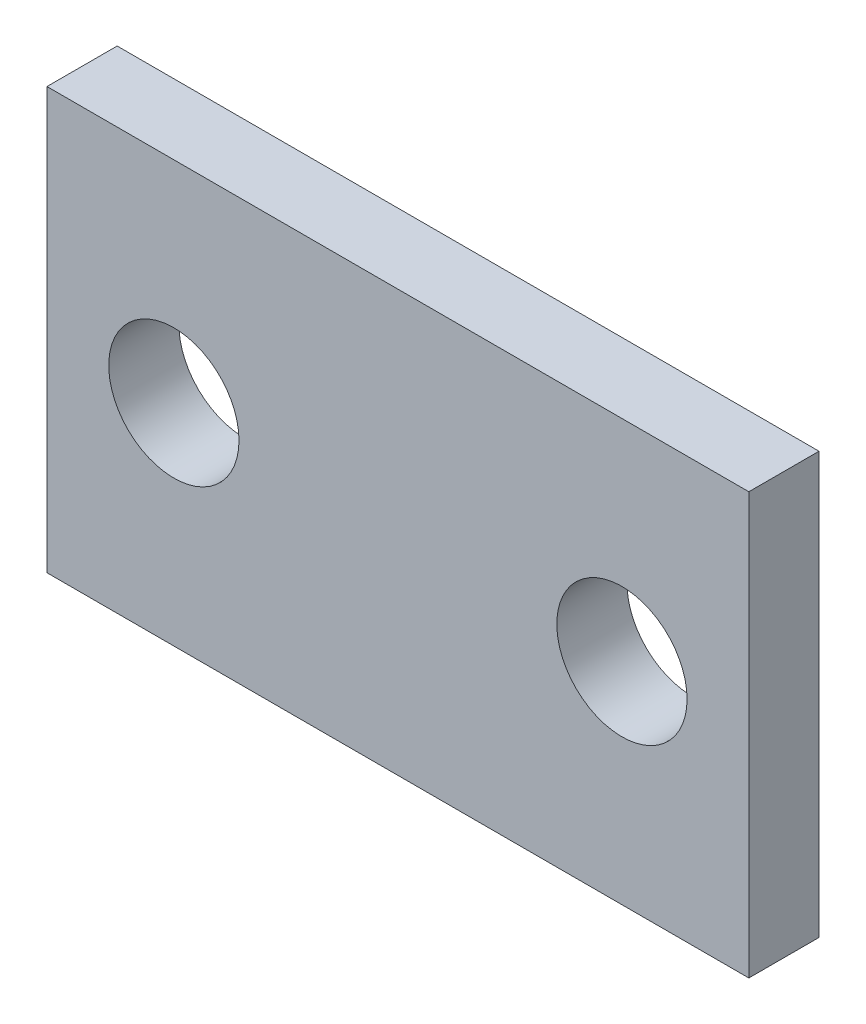
ISO-10303-21;
HEADER;
FILE_DESCRIPTION(('STEP AP214'),'2;1');
FILE_NAME('part.step','',(''),(''),'','','');
FILE_SCHEMA(('AUTOMOTIVE_DESIGN { 1 0 10303 214 1 1 1 1 }'));
ENDSEC;
DATA;
#1=APPLICATION_CONTEXT('core data for automotive mechanical design processes');
#2=APPLICATION_PROTOCOL_DEFINITION('international standard','automotive_design',2000,#1);
#3=PRODUCT_CONTEXT('',#1,'mechanical');
#4=PRODUCT('Part','Part','',(#3));
#5=PRODUCT_RELATED_PRODUCT_CATEGORY('part','',(#4));
#6=PRODUCT_DEFINITION_FORMATION('','',#4);
#7=PRODUCT_DEFINITION_CONTEXT('part definition',#1,'design');
#8=PRODUCT_DEFINITION('design','',#6,#7);
#9=PRODUCT_DEFINITION_SHAPE('','',#8);
#10=(LENGTH_UNIT() NAMED_UNIT(*) SI_UNIT(.MILLI.,.METRE.));
#11=(NAMED_UNIT(*) PLANE_ANGLE_UNIT() SI_UNIT($,.RADIAN.));
#12=(NAMED_UNIT(*) SI_UNIT($,.STERADIAN.) SOLID_ANGLE_UNIT());
#13=UNCERTAINTY_MEASURE_WITH_UNIT(LENGTH_MEASURE(1.E-05),#10,'distance_accuracy_value','');
#14=(GEOMETRIC_REPRESENTATION_CONTEXT(3) GLOBAL_UNCERTAINTY_ASSIGNED_CONTEXT((#13)) GLOBAL_UNIT_ASSIGNED_CONTEXT((#10,
#11,#12)) REPRESENTATION_CONTEXT('',''));
#15=CARTESIAN_POINT('',(0.,0.,0.));
#16=DIRECTION('',(0.,0.,1.));
#17=DIRECTION('',(1.,0.,0.));
#18=AXIS2_PLACEMENT_3D('',#15,#16,#17);
#19=CARTESIAN_POINT('',(7.9375,4.76250000000001,1.5875));
#20=DIRECTION('',(-1.,0.,0.));
#21=DIRECTION('',(0.,-1.,0.));
#22=AXIS2_PLACEMENT_3D('',#19,#20,#21);
#23=PLANE('',#22);
#24=DIRECTION('',(0.,1.,0.));
#25=VECTOR('',#24,1.);
#26=CARTESIAN_POINT('',(7.9375,4.76250000000001,0.));
#27=LINE('',#26,#25);
#28=CARTESIAN_POINT('',(7.9375,-4.7625,0.));
#29=VERTEX_POINT('',#28);
#30=CARTESIAN_POINT('',(7.9375,4.76250000000001,0.));
#31=VERTEX_POINT('',#30);
#32=EDGE_CURVE('E98',#29,#31,#27,.T.);
#33=ORIENTED_EDGE('',*,*,#32,.T.);
#34=DIRECTION('',(0.,0.,-1.));
#35=VECTOR('',#34,1.);
#36=CARTESIAN_POINT('',(7.9375,4.76250000000001,1.5875));
#37=LINE('',#36,#35);
#38=CARTESIAN_POINT('',(7.9375,4.76250000000001,1.5875));
#39=VERTEX_POINT('',#38);
#40=EDGE_CURVE('E11',#39,#31,#37,.T.);
#41=ORIENTED_EDGE('',*,*,#40,.F.);
#42=DIRECTION('',(0.,1.,0.));
#43=VECTOR('',#42,1.);
#44=CARTESIAN_POINT('',(7.9375,4.76250000000001,1.5875));
#45=LINE('',#44,#43);
#46=CARTESIAN_POINT('',(7.9375,-4.7625,1.5875));
#47=VERTEX_POINT('',#46);
#48=EDGE_CURVE('E86',#47,#39,#45,.T.);
#49=ORIENTED_EDGE('',*,*,#48,.F.);
#50=DIRECTION('',(0.,0.,-1.));
#51=VECTOR('',#50,1.);
#52=CARTESIAN_POINT('',(7.9375,-4.7625,1.5875));
#53=LINE('',#52,#51);
#54=EDGE_CURVE('E94',#47,#29,#53,.T.);
#55=ORIENTED_EDGE('',*,*,#54,.T.);
#56=EDGE_LOOP('',(#33,#41,#49,#55));
#57=FACE_BOUND('',#56,.T.);
#58=ADVANCED_FACE('F35',(#57),#23,.F.);
#59=CARTESIAN_POINT('',(-7.9375,4.76250000000001,1.5875));
#60=DIRECTION('',(0.,-1.,0.));
#61=DIRECTION('',(0.,0.,-1.));
#62=AXIS2_PLACEMENT_3D('',#59,#60,#61);
#63=PLANE('',#62);
#64=DIRECTION('',(-1.,0.,0.));
#65=VECTOR('',#64,1.);
#66=CARTESIAN_POINT('',(-7.9375,4.76250000000001,0.));
#67=LINE('',#66,#65);
#68=CARTESIAN_POINT('',(-7.9375,4.76250000000001,0.));
#69=VERTEX_POINT('',#68);
#70=EDGE_CURVE('E90',#31,#69,#67,.T.);
#71=ORIENTED_EDGE('',*,*,#70,.T.);
#72=DIRECTION('',(0.,0.,-1.));
#73=VECTOR('',#72,1.);
#74=CARTESIAN_POINT('',(-7.9375,4.76250000000001,1.5875));
#75=LINE('',#74,#73);
#76=CARTESIAN_POINT('',(-7.9375,4.76250000000001,1.5875));
#77=VERTEX_POINT('',#76);
#78=EDGE_CURVE('E43',#77,#69,#75,.T.);
#79=ORIENTED_EDGE('',*,*,#78,.F.);
#80=DIRECTION('',(-1.,0.,0.));
#81=VECTOR('',#80,1.);
#82=CARTESIAN_POINT('',(-7.9375,4.76250000000001,1.5875));
#83=LINE('',#82,#81);
#84=EDGE_CURVE('E81',#39,#77,#83,.T.);
#85=ORIENTED_EDGE('',*,*,#84,.F.);
#86=ORIENTED_EDGE('',*,*,#40,.T.);
#87=EDGE_LOOP('',(#71,#79,#85,#86));
#88=FACE_BOUND('',#87,.T.);
#89=ADVANCED_FACE('F89',(#88),#63,.F.);
#90=CARTESIAN_POINT('',(-7.9375,4.76250000000001,1.5875));
#91=DIRECTION('',(1.,0.,0.));
#92=DIRECTION('',(0.,1.,0.));
#93=AXIS2_PLACEMENT_3D('',#90,#91,#92);
#94=PLANE('',#93);
#95=DIRECTION('',(0.,-1.,0.));
#96=VECTOR('',#95,1.);
#97=CARTESIAN_POINT('',(-7.9375,4.76250000000001,0.));
#98=LINE('',#97,#96);
#99=CARTESIAN_POINT('',(-7.9375,-4.7625,0.));
#100=VERTEX_POINT('',#99);
#101=EDGE_CURVE('E68',#69,#100,#98,.T.);
#102=ORIENTED_EDGE('',*,*,#101,.T.);
#103=DIRECTION('',(0.,0.,-1.));
#104=VECTOR('',#103,1.);
#105=CARTESIAN_POINT('',(-7.9375,-4.7625,1.5875));
#106=LINE('',#105,#104);
#107=CARTESIAN_POINT('',(-7.9375,-4.7625,1.5875));
#108=VERTEX_POINT('',#107);
#109=EDGE_CURVE('E91',#108,#100,#106,.T.);
#110=ORIENTED_EDGE('',*,*,#109,.F.);
#111=DIRECTION('',(0.,-1.,0.));
#112=VECTOR('',#111,1.);
#113=CARTESIAN_POINT('',(-7.9375,4.76250000000001,1.5875));
#114=LINE('',#113,#112);
#115=EDGE_CURVE('E84',#77,#108,#114,.T.);
#116=ORIENTED_EDGE('',*,*,#115,.F.);
#117=ORIENTED_EDGE('',*,*,#78,.T.);
#118=EDGE_LOOP('',(#102,#110,#116,#117));
#119=FACE_BOUND('',#118,.T.);
#120=ADVANCED_FACE('F92',(#119),#94,.F.);
#121=CARTESIAN_POINT('',(-7.9375,-4.7625,1.5875));
#122=DIRECTION('',(0.,1.,0.));
#123=DIRECTION('',(0.,0.,1.));
#124=AXIS2_PLACEMENT_3D('',#121,#122,#123);
#125=PLANE('',#124);
#126=DIRECTION('',(1.,0.,0.));
#127=VECTOR('',#126,1.);
#128=CARTESIAN_POINT('',(-7.9375,-4.7625,0.));
#129=LINE('',#128,#127);
#130=EDGE_CURVE('E74',#100,#29,#129,.T.);
#131=ORIENTED_EDGE('',*,*,#130,.T.);
#132=ORIENTED_EDGE('',*,*,#54,.F.);
#133=DIRECTION('',(1.,0.,0.));
#134=VECTOR('',#133,1.);
#135=CARTESIAN_POINT('',(-7.9375,-4.7625,1.5875));
#136=LINE('',#135,#134);
#137=EDGE_CURVE('E51',#108,#47,#136,.T.);
#138=ORIENTED_EDGE('',*,*,#137,.F.);
#139=ORIENTED_EDGE('',*,*,#109,.T.);
#140=EDGE_LOOP('',(#131,#132,#138,#139));
#141=FACE_BOUND('',#140,.T.);
#142=ADVANCED_FACE('F106',(#141),#125,.F.);
#143=CARTESIAN_POINT('',(7.9375,-4.7625,1.5875));
#144=DIRECTION('',(0.,0.,1.));
#145=DIRECTION('',(1.,0.,0.));
#146=AXIS2_PLACEMENT_3D('',#143,#144,#145);
#147=PLANE('',#146);
#148=CARTESIAN_POINT('',(-5.0673,0.,1.5875));
#149=DIRECTION('',(0.,0.,1.));
#150=DIRECTION('',(1.,0.,0.));
#151=AXIS2_PLACEMENT_3D('',#148,#149,#150);
#152=CIRCLE('',#151,1.47319999999999);
#153=CARTESIAN_POINT('',(-3.59410000000001,0.,1.5875));
#154=VERTEX_POINT('',#153);
#155=EDGE_CURVE('E120',#154,#154,#152,.T.);
#156=ORIENTED_EDGE('',*,*,#155,.F.);
#157=EDGE_LOOP('',(#156));
#158=FACE_BOUND('',#157,.T.);
#159=CARTESIAN_POINT('',(5.0673,0.,1.5875));
#160=DIRECTION('',(0.,0.,1.));
#161=DIRECTION('',(1.,0.,0.));
#162=AXIS2_PLACEMENT_3D('',#159,#160,#161);
#163=CIRCLE('',#162,1.47319999999999);
#164=CARTESIAN_POINT('',(6.54049999999999,0.,1.5875));
#165=VERTEX_POINT('',#164);
#166=EDGE_CURVE('E114',#165,#165,#163,.T.);
#167=ORIENTED_EDGE('',*,*,#166,.F.);
#168=EDGE_LOOP('',(#167));
#169=FACE_BOUND('',#168,.T.);
#170=ORIENTED_EDGE('',*,*,#48,.T.);
#171=ORIENTED_EDGE('',*,*,#84,.T.);
#172=ORIENTED_EDGE('',*,*,#115,.T.);
#173=ORIENTED_EDGE('',*,*,#137,.T.);
#174=EDGE_LOOP('',(#170,#171,#172,#173));
#175=FACE_BOUND('',#174,.T.);
#176=ADVANCED_FACE('F82',(#158,#169,#175),#147,.T.);
#177=CARTESIAN_POINT('',(7.9375,-4.7625,0.));
#178=DIRECTION('',(0.,0.,1.));
#179=DIRECTION('',(1.,0.,0.));
#180=AXIS2_PLACEMENT_3D('',#177,#178,#179);
#181=PLANE('',#180);
#182=CARTESIAN_POINT('',(-5.0673,0.,0.));
#183=DIRECTION('',(0.,0.,1.));
#184=DIRECTION('',(1.,0.,0.));
#185=AXIS2_PLACEMENT_3D('',#182,#183,#184);
#186=CIRCLE('',#185,1.47319999999999);
#187=CARTESIAN_POINT('',(-3.59410000000001,0.,0.));
#188=VERTEX_POINT('',#187);
#189=EDGE_CURVE('E117',#188,#188,#186,.T.);
#190=ORIENTED_EDGE('',*,*,#189,.T.);
#191=EDGE_LOOP('',(#190));
#192=FACE_BOUND('',#191,.T.);
#193=CARTESIAN_POINT('',(5.0673,0.,0.));
#194=DIRECTION('',(0.,0.,1.));
#195=DIRECTION('',(1.,0.,0.));
#196=AXIS2_PLACEMENT_3D('',#193,#194,#195);
#197=CIRCLE('',#196,1.47319999999999);
#198=CARTESIAN_POINT('',(6.54049999999999,0.,0.));
#199=VERTEX_POINT('',#198);
#200=EDGE_CURVE('E101',#199,#199,#197,.T.);
#201=ORIENTED_EDGE('',*,*,#200,.T.);
#202=EDGE_LOOP('',(#201));
#203=FACE_BOUND('',#202,.T.);
#204=ORIENTED_EDGE('',*,*,#32,.F.);
#205=ORIENTED_EDGE('',*,*,#130,.F.);
#206=ORIENTED_EDGE('',*,*,#101,.F.);
#207=ORIENTED_EDGE('',*,*,#70,.F.);
#208=EDGE_LOOP('',(#204,#205,#206,#207));
#209=FACE_BOUND('',#208,.T.);
#210=ADVANCED_FACE('F109',(#192,#203,#209),#181,.F.);
#211=CARTESIAN_POINT('',(5.0673,0.,1.5875));
#212=DIRECTION('',(0.,0.,1.));
#213=DIRECTION('',(1.,0.,0.));
#214=AXIS2_PLACEMENT_3D('',#211,#212,#213);
#215=CYLINDRICAL_SURFACE('',#214,1.47319999999999);
#216=ORIENTED_EDGE('',*,*,#200,.F.);
#217=EDGE_LOOP('',(#216));
#218=FACE_BOUND('',#217,.T.);
#219=ORIENTED_EDGE('',*,*,#166,.T.);
#220=EDGE_LOOP('',(#219));
#221=FACE_BOUND('',#220,.T.);
#222=ADVANCED_FACE('F131',(#218,#221),#215,.F.);
#223=CARTESIAN_POINT('',(-5.0673,0.,1.5875));
#224=DIRECTION('',(0.,0.,1.));
#225=DIRECTION('',(1.,0.,0.));
#226=AXIS2_PLACEMENT_3D('',#223,#224,#225);
#227=CYLINDRICAL_SURFACE('',#226,1.47319999999999);
#228=ORIENTED_EDGE('',*,*,#189,.F.);
#229=EDGE_LOOP('',(#228));
#230=FACE_BOUND('',#229,.T.);
#231=ORIENTED_EDGE('',*,*,#155,.T.);
#232=EDGE_LOOP('',(#231));
#233=FACE_BOUND('',#232,.T.);
#234=ADVANCED_FACE('F124',(#230,#233),#227,.F.);
#235=CLOSED_SHELL('',(#58,#89,#120,#142,#176,#210,#222,#234));
#236=MANIFOLD_SOLID_BREP('B2',#235);
#237=ADVANCED_BREP_SHAPE_REPRESENTATION('',(#18,#236),#14);
#238=SHAPE_DEFINITION_REPRESENTATION(#9,#237);
ENDSEC;
END-ISO-10303-21;
